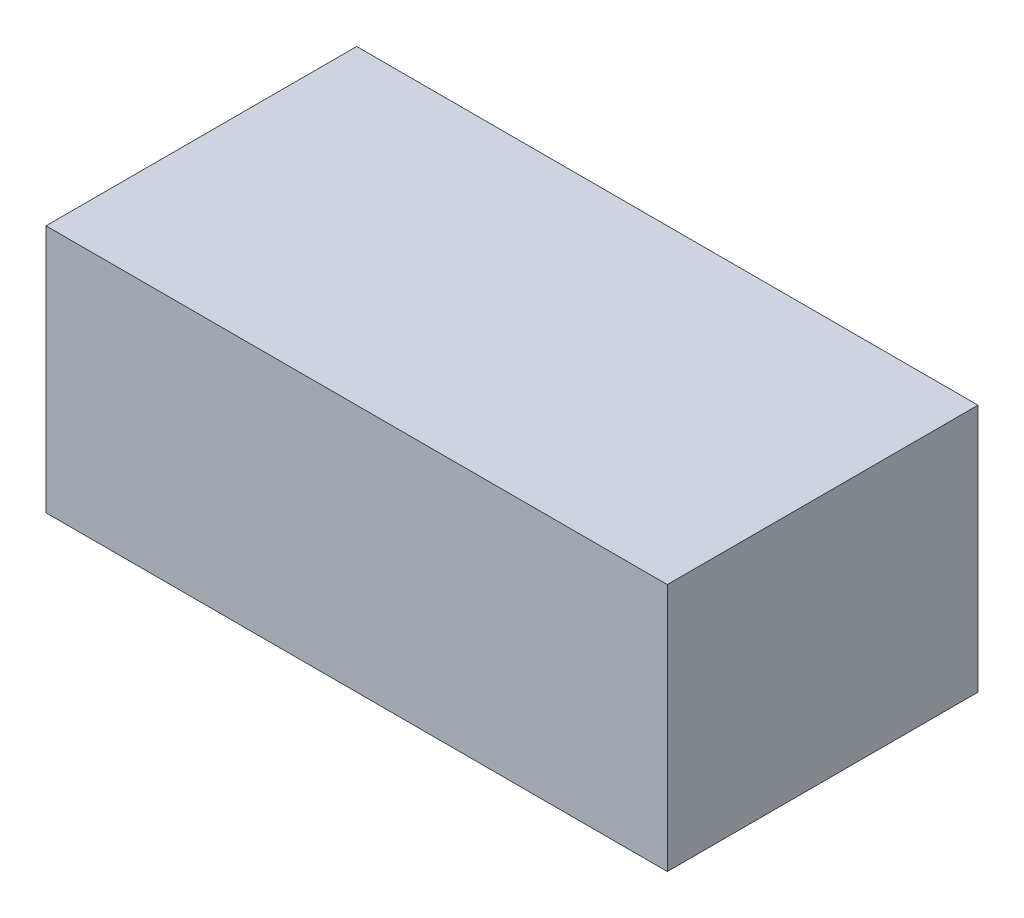
ISO-10303-21;
HEADER;
FILE_DESCRIPTION(('STEP AP214'),'2;1');
FILE_NAME('part.step','',(''),(''),'','','');
FILE_SCHEMA(('AUTOMOTIVE_DESIGN { 1 0 10303 214 1 1 1 1 }'));
ENDSEC;
DATA;
#1=APPLICATION_CONTEXT('core data for automotive mechanical design processes');
#2=APPLICATION_PROTOCOL_DEFINITION('international standard','automotive_design',2000,#1);
#3=PRODUCT_CONTEXT('',#1,'mechanical');
#4=PRODUCT('Part','Part','',(#3));
#5=PRODUCT_RELATED_PRODUCT_CATEGORY('part','',(#4));
#6=PRODUCT_DEFINITION_FORMATION('','',#4);
#7=PRODUCT_DEFINITION_CONTEXT('part definition',#1,'design');
#8=PRODUCT_DEFINITION('design','',#6,#7);
#9=PRODUCT_DEFINITION_SHAPE('','',#8);
#10=(LENGTH_UNIT() NAMED_UNIT(*) SI_UNIT(.MILLI.,.METRE.));
#11=(NAMED_UNIT(*) PLANE_ANGLE_UNIT() SI_UNIT($,.RADIAN.));
#12=(NAMED_UNIT(*) SI_UNIT($,.STERADIAN.) SOLID_ANGLE_UNIT());
#13=UNCERTAINTY_MEASURE_WITH_UNIT(LENGTH_MEASURE(1.E-05),#10,'distance_accuracy_value','');
#14=(GEOMETRIC_REPRESENTATION_CONTEXT(3) GLOBAL_UNCERTAINTY_ASSIGNED_CONTEXT((#13)) GLOBAL_UNIT_ASSIGNED_CONTEXT((#10,
#11,#12)) REPRESENTATION_CONTEXT('',''));
#15=CARTESIAN_POINT('',(0.,0.,0.));
#16=DIRECTION('',(0.,0.,1.));
#17=DIRECTION('',(1.,0.,0.));
#18=AXIS2_PLACEMENT_3D('',#15,#16,#17);
#19=CARTESIAN_POINT('',(0.,8.,0.));
#20=DIRECTION('',(1.,0.,0.));
#21=DIRECTION('',(0.,0.,-1.));
#22=AXIS2_PLACEMENT_3D('',#19,#20,#21);
#23=PLANE('',#22);
#24=DIRECTION('',(0.,0.,1.));
#25=VECTOR('',#24,1.);
#26=CARTESIAN_POINT('',(0.,0.,0.));
#27=LINE('',#26,#25);
#28=CARTESIAN_POINT('',(0.,0.,-10.));
#29=VERTEX_POINT('',#28);
#30=CARTESIAN_POINT('',(0.,0.,0.));
#31=VERTEX_POINT('',#30);
#32=EDGE_CURVE('E107',#29,#31,#27,.T.);
#33=ORIENTED_EDGE('',*,*,#32,.T.);
#34=DIRECTION('',(0.,-1.,0.));
#35=VECTOR('',#34,1.);
#36=CARTESIAN_POINT('',(0.,8.,0.));
#37=LINE('',#36,#35);
#38=CARTESIAN_POINT('',(0.,8.,0.));
#39=VERTEX_POINT('',#38);
#40=EDGE_CURVE('E11',#39,#31,#37,.T.);
#41=ORIENTED_EDGE('',*,*,#40,.F.);
#42=DIRECTION('',(0.,0.,1.));
#43=VECTOR('',#42,1.);
#44=CARTESIAN_POINT('',(0.,8.,0.));
#45=LINE('',#44,#43);
#46=CARTESIAN_POINT('',(0.,8.,-10.));
#47=VERTEX_POINT('',#46);
#48=EDGE_CURVE('E91',#47,#39,#45,.T.);
#49=ORIENTED_EDGE('',*,*,#48,.F.);
#50=DIRECTION('',(0.,-1.,0.));
#51=VECTOR('',#50,1.);
#52=CARTESIAN_POINT('',(0.,8.,-10.));
#53=LINE('',#52,#51);
#54=EDGE_CURVE('E103',#47,#29,#53,.T.);
#55=ORIENTED_EDGE('',*,*,#54,.T.);
#56=EDGE_LOOP('',(#33,#41,#49,#55));
#57=FACE_BOUND('',#56,.T.);
#58=ADVANCED_FACE('F39',(#57),#23,.F.);
#59=CARTESIAN_POINT('',(0.,8.,0.));
#60=DIRECTION('',(0.,0.,-1.));
#61=DIRECTION('',(-1.,0.,0.));
#62=AXIS2_PLACEMENT_3D('',#59,#60,#61);
#63=PLANE('',#62);
#64=DIRECTION('',(1.,0.,0.));
#65=VECTOR('',#64,1.);
#66=CARTESIAN_POINT('',(0.,0.,0.));
#67=LINE('',#66,#65);
#68=CARTESIAN_POINT('',(20.,0.,0.));
#69=VERTEX_POINT('',#68);
#70=EDGE_CURVE('E96',#31,#69,#67,.T.);
#71=ORIENTED_EDGE('',*,*,#70,.T.);
#72=DIRECTION('',(0.,-1.,0.));
#73=VECTOR('',#72,1.);
#74=CARTESIAN_POINT('',(20.,8.,0.));
#75=LINE('',#74,#73);
#76=CARTESIAN_POINT('',(20.,8.,0.));
#77=VERTEX_POINT('',#76);
#78=EDGE_CURVE('E48',#77,#69,#75,.T.);
#79=ORIENTED_EDGE('',*,*,#78,.F.);
#80=DIRECTION('',(1.,0.,0.));
#81=VECTOR('',#80,1.);
#82=CARTESIAN_POINT('',(0.,8.,0.));
#83=LINE('',#82,#81);
#84=EDGE_CURVE('E86',#39,#77,#83,.T.);
#85=ORIENTED_EDGE('',*,*,#84,.F.);
#86=ORIENTED_EDGE('',*,*,#40,.T.);
#87=EDGE_LOOP('',(#71,#79,#85,#86));
#88=FACE_BOUND('',#87,.T.);
#89=ADVANCED_FACE('F95',(#88),#63,.F.);
#90=CARTESIAN_POINT('',(20.,8.,0.));
#91=DIRECTION('',(-1.,0.,0.));
#92=DIRECTION('',(0.,0.,1.));
#93=AXIS2_PLACEMENT_3D('',#90,#91,#92);
#94=PLANE('',#93);
#95=DIRECTION('',(0.,0.,-1.));
#96=VECTOR('',#95,1.);
#97=CARTESIAN_POINT('',(20.,0.,0.));
#98=LINE('',#97,#96);
#99=CARTESIAN_POINT('',(20.,0.,-10.));
#100=VERTEX_POINT('',#99);
#101=EDGE_CURVE('E73',#69,#100,#98,.T.);
#102=ORIENTED_EDGE('',*,*,#101,.T.);
#103=DIRECTION('',(0.,-1.,0.));
#104=VECTOR('',#103,1.);
#105=CARTESIAN_POINT('',(20.,8.,-10.));
#106=LINE('',#105,#104);
#107=CARTESIAN_POINT('',(20.,8.,-10.));
#108=VERTEX_POINT('',#107);
#109=EDGE_CURVE('E98',#108,#100,#106,.T.);
#110=ORIENTED_EDGE('',*,*,#109,.F.);
#111=DIRECTION('',(0.,0.,-1.));
#112=VECTOR('',#111,1.);
#113=CARTESIAN_POINT('',(20.,8.,0.));
#114=LINE('',#113,#112);
#115=EDGE_CURVE('E89',#77,#108,#114,.T.);
#116=ORIENTED_EDGE('',*,*,#115,.F.);
#117=ORIENTED_EDGE('',*,*,#78,.T.);
#118=EDGE_LOOP('',(#102,#110,#116,#117));
#119=FACE_BOUND('',#118,.T.);
#120=ADVANCED_FACE('F99',(#119),#94,.F.);
#121=CARTESIAN_POINT('',(0.,8.,-10.));
#122=DIRECTION('',(0.,0.,1.));
#123=DIRECTION('',(1.,0.,0.));
#124=AXIS2_PLACEMENT_3D('',#121,#122,#123);
#125=PLANE('',#124);
#126=DIRECTION('',(-1.,0.,0.));
#127=VECTOR('',#126,1.);
#128=CARTESIAN_POINT('',(0.,0.,-10.));
#129=LINE('',#128,#127);
#130=EDGE_CURVE('E79',#100,#29,#129,.T.);
#131=ORIENTED_EDGE('',*,*,#130,.T.);
#132=ORIENTED_EDGE('',*,*,#54,.F.);
#133=DIRECTION('',(-1.,0.,0.));
#134=VECTOR('',#133,1.);
#135=CARTESIAN_POINT('',(0.,8.,-10.));
#136=LINE('',#135,#134);
#137=EDGE_CURVE('E56',#108,#47,#136,.T.);
#138=ORIENTED_EDGE('',*,*,#137,.F.);
#139=ORIENTED_EDGE('',*,*,#109,.T.);
#140=EDGE_LOOP('',(#131,#132,#138,#139));
#141=FACE_BOUND('',#140,.T.);
#142=ADVANCED_FACE('F120',(#141),#125,.F.);
#143=CARTESIAN_POINT('',(0.,8.,0.));
#144=DIRECTION('',(0.,-1.,0.));
#145=DIRECTION('',(0.,0.,-1.));
#146=AXIS2_PLACEMENT_3D('',#143,#144,#145);
#147=PLANE('',#146);
#148=ORIENTED_EDGE('',*,*,#48,.T.);
#149=ORIENTED_EDGE('',*,*,#84,.T.);
#150=ORIENTED_EDGE('',*,*,#115,.T.);
#151=ORIENTED_EDGE('',*,*,#137,.T.);
#152=EDGE_LOOP('',(#148,#149,#150,#151));
#153=FACE_BOUND('',#152,.T.);
#154=ADVANCED_FACE('F87',(#153),#147,.F.);
#155=CARTESIAN_POINT('',(0.,0.,0.));
#156=DIRECTION('',(0.,-1.,0.));
#157=DIRECTION('',(0.,0.,-1.));
#158=AXIS2_PLACEMENT_3D('',#155,#156,#157);
#159=PLANE('',#158);
#160=ORIENTED_EDGE('',*,*,#32,.F.);
#161=ORIENTED_EDGE('',*,*,#130,.F.);
#162=ORIENTED_EDGE('',*,*,#101,.F.);
#163=ORIENTED_EDGE('',*,*,#70,.F.);
#164=EDGE_LOOP('',(#160,#161,#162,#163));
#165=FACE_BOUND('',#164,.T.);
#166=ADVANCED_FACE('F123',(#165),#159,.T.);
#167=CLOSED_SHELL('',(#58,#89,#120,#142,#154,#166));
#168=MANIFOLD_SOLID_BREP('B2',#167);
#169=ADVANCED_BREP_SHAPE_REPRESENTATION('',(#18,#168),#14);
#170=SHAPE_DEFINITION_REPRESENTATION(#9,#169);
ENDSEC;
END-ISO-10303-21;
